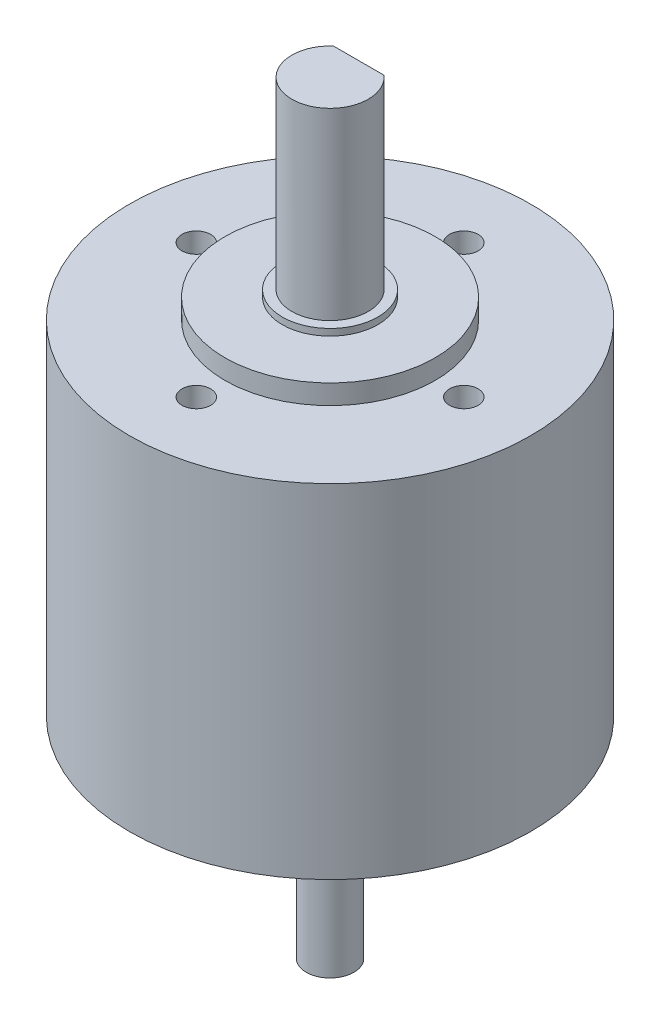
ISO-10303-21;
HEADER;
FILE_DESCRIPTION(('STEP AP214'),'2;1');
FILE_NAME('part.step','',(''),(''),'','','');
FILE_SCHEMA(('AUTOMOTIVE_DESIGN { 1 0 10303 214 1 1 1 1 }'));
ENDSEC;
DATA;
#1=APPLICATION_CONTEXT('core data for automotive mechanical design processes');
#2=APPLICATION_PROTOCOL_DEFINITION('international standard','automotive_design',2000,#1);
#3=PRODUCT_CONTEXT('',#1,'mechanical');
#4=PRODUCT('Part','Part','',(#3));
#5=PRODUCT_RELATED_PRODUCT_CATEGORY('part','',(#4));
#6=PRODUCT_DEFINITION_FORMATION('','',#4);
#7=PRODUCT_DEFINITION_CONTEXT('part definition',#1,'design');
#8=PRODUCT_DEFINITION('design','',#6,#7);
#9=PRODUCT_DEFINITION_SHAPE('','',#8);
#10=(LENGTH_UNIT() NAMED_UNIT(*) SI_UNIT(.MILLI.,.METRE.));
#11=(NAMED_UNIT(*) PLANE_ANGLE_UNIT() SI_UNIT($,.RADIAN.));
#12=(NAMED_UNIT(*) SI_UNIT($,.STERADIAN.) SOLID_ANGLE_UNIT());
#13=UNCERTAINTY_MEASURE_WITH_UNIT(LENGTH_MEASURE(1.E-05),#10,'distance_accuracy_value','');
#14=(GEOMETRIC_REPRESENTATION_CONTEXT(3) GLOBAL_UNCERTAINTY_ASSIGNED_CONTEXT((#13)) GLOBAL_UNIT_ASSIGNED_CONTEXT((#10,
#11,#12)) REPRESENTATION_CONTEXT('',''));
#15=CARTESIAN_POINT('',(0.,0.,0.));
#16=DIRECTION('',(0.,0.,1.));
#17=DIRECTION('',(1.,0.,0.));
#18=AXIS2_PLACEMENT_3D('',#15,#16,#17);
#19=CARTESIAN_POINT('',(0.,17.9451,0.));
#20=DIRECTION('',(0.,-1.,0.));
#21=DIRECTION('',(0.,0.,-1.));
#22=AXIS2_PLACEMENT_3D('',#19,#20,#21);
#23=CYLINDRICAL_SURFACE('',#22,21.);
#24=CARTESIAN_POINT('',(0.,17.9451,0.));
#25=DIRECTION('',(0.,1.,0.));
#26=DIRECTION('',(0.,0.,1.));
#27=AXIS2_PLACEMENT_3D('',#24,#25,#26);
#28=CIRCLE('',#27,21.);
#29=CARTESIAN_POINT('',(0.,17.9451,21.));
#30=VERTEX_POINT('',#29);
#31=EDGE_CURVE('E150',#30,#30,#28,.T.);
#32=ORIENTED_EDGE('',*,*,#31,.F.);
#33=EDGE_LOOP('',(#32));
#34=FACE_BOUND('',#33,.T.);
#35=CARTESIAN_POINT('',(0.,-17.9451,0.));
#36=DIRECTION('',(0.,1.,0.));
#37=DIRECTION('',(0.,0.,1.));
#38=AXIS2_PLACEMENT_3D('',#35,#36,#37);
#39=CIRCLE('',#38,21.);
#40=CARTESIAN_POINT('',(0.,-17.9451,21.));
#41=VERTEX_POINT('',#40);
#42=EDGE_CURVE('E149',#41,#41,#39,.T.);
#43=ORIENTED_EDGE('',*,*,#42,.T.);
#44=EDGE_LOOP('',(#43));
#45=FACE_BOUND('',#44,.T.);
#46=ADVANCED_FACE('F38',(#34,#45),#23,.T.);
#47=CARTESIAN_POINT('',(0.,17.9451,0.));
#48=DIRECTION('',(0.,1.,0.));
#49=DIRECTION('',(0.,0.,1.));
#50=AXIS2_PLACEMENT_3D('',#47,#48,#49);
#51=PLANE('',#50);
#52=CARTESIAN_POINT('',(0.,17.9451,-14.));
#53=DIRECTION('',(0.,1.,0.));
#54=DIRECTION('',(0.,0.,1.));
#55=AXIS2_PLACEMENT_3D('',#52,#53,#54);
#56=CIRCLE('',#55,1.5);
#57=CARTESIAN_POINT('',(0.,17.9451,-12.5));
#58=VERTEX_POINT('',#57);
#59=EDGE_CURVE('E107',#58,#58,#56,.T.);
#60=ORIENTED_EDGE('',*,*,#59,.F.);
#61=EDGE_LOOP('',(#60));
#62=FACE_BOUND('',#61,.T.);
#63=CARTESIAN_POINT('',(-14.,17.9451,0.));
#64=DIRECTION('',(0.,1.,0.));
#65=DIRECTION('',(0.,0.,1.));
#66=AXIS2_PLACEMENT_3D('',#63,#64,#65);
#67=CIRCLE('',#66,1.5);
#68=CARTESIAN_POINT('',(-14.,17.9451,1.5));
#69=VERTEX_POINT('',#68);
#70=EDGE_CURVE('E113',#69,#69,#67,.T.);
#71=ORIENTED_EDGE('',*,*,#70,.F.);
#72=EDGE_LOOP('',(#71));
#73=FACE_BOUND('',#72,.T.);
#74=CARTESIAN_POINT('',(0.,17.9451,14.));
#75=DIRECTION('',(0.,1.,0.));
#76=DIRECTION('',(0.,0.,1.));
#77=AXIS2_PLACEMENT_3D('',#74,#75,#76);
#78=CIRCLE('',#77,1.5);
#79=CARTESIAN_POINT('',(0.,17.9451,15.5));
#80=VERTEX_POINT('',#79);
#81=EDGE_CURVE('E119',#80,#80,#78,.T.);
#82=ORIENTED_EDGE('',*,*,#81,.F.);
#83=EDGE_LOOP('',(#82));
#84=FACE_BOUND('',#83,.T.);
#85=CARTESIAN_POINT('',(14.,17.9451,0.));
#86=DIRECTION('',(0.,1.,0.));
#87=DIRECTION('',(0.,0.,1.));
#88=AXIS2_PLACEMENT_3D('',#85,#86,#87);
#89=CIRCLE('',#88,1.5);
#90=CARTESIAN_POINT('',(14.,17.9451,1.5));
#91=VERTEX_POINT('',#90);
#92=EDGE_CURVE('E102',#91,#91,#89,.T.);
#93=ORIENTED_EDGE('',*,*,#92,.F.);
#94=EDGE_LOOP('',(#93));
#95=FACE_BOUND('',#94,.T.);
#96=CARTESIAN_POINT('',(0.,17.9451,0.));
#97=DIRECTION('',(0.,1.,0.));
#98=DIRECTION('',(0.,0.,1.));
#99=AXIS2_PLACEMENT_3D('',#96,#97,#98);
#100=CIRCLE('',#99,11.);
#101=CARTESIAN_POINT('',(0.,17.9451,11.));
#102=VERTEX_POINT('',#101);
#103=EDGE_CURVE('E144',#102,#102,#100,.F.);
#104=ORIENTED_EDGE('',*,*,#103,.T.);
#105=EDGE_LOOP('',(#104));
#106=FACE_BOUND('',#105,.T.);
#107=ORIENTED_EDGE('',*,*,#31,.T.);
#108=EDGE_LOOP('',(#107));
#109=FACE_BOUND('',#108,.T.);
#110=ADVANCED_FACE('F193',(#62,#73,#84,#95,#106,#109),#51,.T.);
#111=CARTESIAN_POINT('',(0.,-17.9451,0.));
#112=DIRECTION('',(0.,1.,0.));
#113=DIRECTION('',(0.,0.,1.));
#114=AXIS2_PLACEMENT_3D('',#111,#112,#113);
#115=PLANE('',#114);
#116=CARTESIAN_POINT('',(0.,-17.9451,0.));
#117=DIRECTION('',(0.,1.,0.));
#118=DIRECTION('',(0.,0.,1.));
#119=AXIS2_PLACEMENT_3D('',#116,#117,#118);
#120=CIRCLE('',#119,11.);
#121=CARTESIAN_POINT('',(0.,-17.9451,11.));
#122=VERTEX_POINT('',#121);
#123=EDGE_CURVE('E153',#122,#122,#120,.F.);
#124=ORIENTED_EDGE('',*,*,#123,.F.);
#125=EDGE_LOOP('',(#124));
#126=FACE_BOUND('',#125,.T.);
#127=ORIENTED_EDGE('',*,*,#42,.F.);
#128=EDGE_LOOP('',(#127));
#129=FACE_BOUND('',#128,.T.);
#130=ADVANCED_FACE('F198',(#126,#129),#115,.F.);
#131=CARTESIAN_POINT('',(0.,-20.0025,0.));
#132=DIRECTION('',(0.,1.,0.));
#133=DIRECTION('',(0.,0.,1.));
#134=AXIS2_PLACEMENT_3D('',#131,#132,#133);
#135=PLANE('',#134);
#136=CARTESIAN_POINT('',(0.,-20.0025,0.));
#137=DIRECTION('',(0.,1.,0.));
#138=DIRECTION('',(0.,0.,1.));
#139=AXIS2_PLACEMENT_3D('',#136,#137,#138);
#140=CIRCLE('',#139,5.);
#141=CARTESIAN_POINT('',(0.,-20.0025,5.));
#142=VERTEX_POINT('',#141);
#143=EDGE_CURVE('E13',#142,#142,#140,.F.);
#144=ORIENTED_EDGE('',*,*,#143,.F.);
#145=EDGE_LOOP('',(#144));
#146=FACE_BOUND('',#145,.T.);
#147=CARTESIAN_POINT('',(0.,-20.0025,0.));
#148=DIRECTION('',(0.,1.,0.));
#149=DIRECTION('',(0.,0.,1.));
#150=AXIS2_PLACEMENT_3D('',#147,#148,#149);
#151=CIRCLE('',#150,11.);
#152=CARTESIAN_POINT('',(0.,-20.0025,11.));
#153=VERTEX_POINT('',#152);
#154=EDGE_CURVE('E140',#153,#153,#151,.T.);
#155=ORIENTED_EDGE('',*,*,#154,.F.);
#156=EDGE_LOOP('',(#155));
#157=FACE_BOUND('',#156,.T.);
#158=ADVANCED_FACE('F206',(#146,#157),#135,.F.);
#159=CARTESIAN_POINT('',(0.,20.0025,0.));
#160=DIRECTION('',(0.,-1.,0.));
#161=DIRECTION('',(0.,0.,-1.));
#162=AXIS2_PLACEMENT_3D('',#159,#160,#161);
#163=CYLINDRICAL_SURFACE('',#162,11.);
#164=ORIENTED_EDGE('',*,*,#154,.T.);
#165=EDGE_LOOP('',(#164));
#166=FACE_BOUND('',#165,.T.);
#167=ORIENTED_EDGE('',*,*,#123,.T.);
#168=EDGE_LOOP('',(#167));
#169=FACE_BOUND('',#168,.T.);
#170=ADVANCED_FACE('F211',(#166,#169),#163,.T.);
#171=ORIENTED_EDGE('',*,*,#103,.F.);
#172=EDGE_LOOP('',(#171));
#173=FACE_BOUND('',#172,.T.);
#174=CARTESIAN_POINT('',(0.,20.0025,0.));
#175=DIRECTION('',(0.,1.,0.));
#176=DIRECTION('',(0.,0.,1.));
#177=AXIS2_PLACEMENT_3D('',#174,#175,#176);
#178=CIRCLE('',#177,11.);
#179=CARTESIAN_POINT('',(0.,20.0025,11.));
#180=VERTEX_POINT('',#179);
#181=EDGE_CURVE('E141',#180,#180,#178,.T.);
#182=ORIENTED_EDGE('',*,*,#181,.F.);
#183=EDGE_LOOP('',(#182));
#184=FACE_BOUND('',#183,.T.);
#185=ADVANCED_FACE('F216',(#173,#184),#163,.T.);
#186=CARTESIAN_POINT('',(0.,20.0025,0.));
#187=DIRECTION('',(0.,1.,0.));
#188=DIRECTION('',(0.,0.,1.));
#189=AXIS2_PLACEMENT_3D('',#186,#187,#188);
#190=PLANE('',#189);
#191=CARTESIAN_POINT('',(0.,20.0025,0.));
#192=DIRECTION('',(0.,1.,0.));
#193=DIRECTION('',(0.,0.,1.));
#194=AXIS2_PLACEMENT_3D('',#191,#192,#193);
#195=CIRCLE('',#194,5.);
#196=CARTESIAN_POINT('',(0.,20.0025,5.));
#197=VERTEX_POINT('',#196);
#198=EDGE_CURVE('E41',#197,#197,#195,.F.);
#199=ORIENTED_EDGE('',*,*,#198,.T.);
#200=EDGE_LOOP('',(#199));
#201=FACE_BOUND('',#200,.T.);
#202=ORIENTED_EDGE('',*,*,#181,.T.);
#203=EDGE_LOOP('',(#202));
#204=FACE_BOUND('',#203,.T.);
#205=ADVANCED_FACE('F218',(#201,#204),#190,.T.);
#206=CARTESIAN_POINT('',(14.,13.9451,0.));
#207=DIRECTION('',(0.,1.,0.));
#208=DIRECTION('',(0.,0.,1.));
#209=AXIS2_PLACEMENT_3D('',#206,#207,#208);
#210=CYLINDRICAL_SURFACE('',#209,1.5);
#211=CARTESIAN_POINT('',(14.,13.9451,0.));
#212=DIRECTION('',(0.,1.,0.));
#213=DIRECTION('',(0.,0.,1.));
#214=AXIS2_PLACEMENT_3D('',#211,#212,#213);
#215=CIRCLE('',#214,1.5);
#216=CARTESIAN_POINT('',(14.,13.9451,1.5));
#217=VERTEX_POINT('',#216);
#218=EDGE_CURVE('E122',#217,#217,#215,.T.);
#219=ORIENTED_EDGE('',*,*,#218,.F.);
#220=EDGE_LOOP('',(#219));
#221=FACE_BOUND('',#220,.T.);
#222=ORIENTED_EDGE('',*,*,#92,.T.);
#223=EDGE_LOOP('',(#222));
#224=FACE_BOUND('',#223,.T.);
#225=ADVANCED_FACE('F223',(#221,#224),#210,.F.);
#226=CARTESIAN_POINT('',(14.,13.9451,0.));
#227=DIRECTION('',(0.,1.,0.));
#228=DIRECTION('',(0.,0.,1.));
#229=AXIS2_PLACEMENT_3D('',#226,#227,#228);
#230=PLANE('',#229);
#231=ORIENTED_EDGE('',*,*,#218,.T.);
#232=EDGE_LOOP('',(#231));
#233=FACE_BOUND('',#232,.T.);
#234=ADVANCED_FACE('F242',(#233),#230,.T.);
#235=CARTESIAN_POINT('',(0.,13.9451,14.));
#236=DIRECTION('',(0.,1.,0.));
#237=DIRECTION('',(0.,0.,1.));
#238=AXIS2_PLACEMENT_3D('',#235,#236,#237);
#239=CYLINDRICAL_SURFACE('',#238,1.5);
#240=CARTESIAN_POINT('',(0.,13.9451,14.));
#241=DIRECTION('',(0.,1.,0.));
#242=DIRECTION('',(0.,0.,1.));
#243=AXIS2_PLACEMENT_3D('',#240,#241,#242);
#244=CIRCLE('',#243,1.5);
#245=CARTESIAN_POINT('',(0.,13.9451,15.5));
#246=VERTEX_POINT('',#245);
#247=EDGE_CURVE('E116',#246,#246,#244,.T.);
#248=ORIENTED_EDGE('',*,*,#247,.F.);
#249=EDGE_LOOP('',(#248));
#250=FACE_BOUND('',#249,.T.);
#251=ORIENTED_EDGE('',*,*,#81,.T.);
#252=EDGE_LOOP('',(#251));
#253=FACE_BOUND('',#252,.T.);
#254=ADVANCED_FACE('F246',(#250,#253),#239,.F.);
#255=CARTESIAN_POINT('',(0.,13.9451,14.));
#256=DIRECTION('',(0.,1.,0.));
#257=DIRECTION('',(0.,0.,1.));
#258=AXIS2_PLACEMENT_3D('',#255,#256,#257);
#259=PLANE('',#258);
#260=ORIENTED_EDGE('',*,*,#247,.T.);
#261=EDGE_LOOP('',(#260));
#262=FACE_BOUND('',#261,.T.);
#263=ADVANCED_FACE('F250',(#262),#259,.T.);
#264=CARTESIAN_POINT('',(-14.,13.9451,0.));
#265=DIRECTION('',(0.,1.,0.));
#266=DIRECTION('',(0.,0.,1.));
#267=AXIS2_PLACEMENT_3D('',#264,#265,#266);
#268=CYLINDRICAL_SURFACE('',#267,1.5);
#269=CARTESIAN_POINT('',(-14.,13.9451,0.));
#270=DIRECTION('',(0.,1.,0.));
#271=DIRECTION('',(0.,0.,1.));
#272=AXIS2_PLACEMENT_3D('',#269,#270,#271);
#273=CIRCLE('',#272,1.5);
#274=CARTESIAN_POINT('',(-14.,13.9451,1.5));
#275=VERTEX_POINT('',#274);
#276=EDGE_CURVE('E110',#275,#275,#273,.T.);
#277=ORIENTED_EDGE('',*,*,#276,.F.);
#278=EDGE_LOOP('',(#277));
#279=FACE_BOUND('',#278,.T.);
#280=ORIENTED_EDGE('',*,*,#70,.T.);
#281=EDGE_LOOP('',(#280));
#282=FACE_BOUND('',#281,.T.);
#283=ADVANCED_FACE('F254',(#279,#282),#268,.F.);
#284=CARTESIAN_POINT('',(-14.,13.9451,0.));
#285=DIRECTION('',(0.,1.,0.));
#286=DIRECTION('',(0.,0.,1.));
#287=AXIS2_PLACEMENT_3D('',#284,#285,#286);
#288=PLANE('',#287);
#289=ORIENTED_EDGE('',*,*,#276,.T.);
#290=EDGE_LOOP('',(#289));
#291=FACE_BOUND('',#290,.T.);
#292=ADVANCED_FACE('F258',(#291),#288,.T.);
#293=CARTESIAN_POINT('',(0.,13.9451,-14.));
#294=DIRECTION('',(0.,1.,0.));
#295=DIRECTION('',(0.,0.,1.));
#296=AXIS2_PLACEMENT_3D('',#293,#294,#295);
#297=CYLINDRICAL_SURFACE('',#296,1.5);
#298=CARTESIAN_POINT('',(0.,13.9451,-14.));
#299=DIRECTION('',(0.,1.,0.));
#300=DIRECTION('',(0.,0.,1.));
#301=AXIS2_PLACEMENT_3D('',#298,#299,#300);
#302=CIRCLE('',#301,1.5);
#303=CARTESIAN_POINT('',(0.,13.9451,-12.5));
#304=VERTEX_POINT('',#303);
#305=EDGE_CURVE('E103',#304,#304,#302,.T.);
#306=ORIENTED_EDGE('',*,*,#305,.F.);
#307=EDGE_LOOP('',(#306));
#308=FACE_BOUND('',#307,.T.);
#309=ORIENTED_EDGE('',*,*,#59,.T.);
#310=EDGE_LOOP('',(#309));
#311=FACE_BOUND('',#310,.T.);
#312=ADVANCED_FACE('F188',(#308,#311),#297,.F.);
#313=CARTESIAN_POINT('',(0.,13.9451,-14.));
#314=DIRECTION('',(0.,1.,0.));
#315=DIRECTION('',(0.,0.,1.));
#316=AXIS2_PLACEMENT_3D('',#313,#314,#315);
#317=PLANE('',#316);
#318=ORIENTED_EDGE('',*,*,#305,.T.);
#319=EDGE_LOOP('',(#318));
#320=FACE_BOUND('',#319,.T.);
#321=ADVANCED_FACE('F179',(#320),#317,.T.);
#322=CARTESIAN_POINT('',(0.,-20.701,0.));
#323=DIRECTION('',(0.,1.,0.));
#324=DIRECTION('',(0.,0.,1.));
#325=AXIS2_PLACEMENT_3D('',#322,#323,#324);
#326=PLANE('',#325);
#327=CARTESIAN_POINT('',(0.,-20.701,0.));
#328=DIRECTION('',(0.,1.,0.));
#329=DIRECTION('',(0.,0.,1.));
#330=AXIS2_PLACEMENT_3D('',#327,#328,#329);
#331=CIRCLE('',#330,2.5);
#332=CARTESIAN_POINT('',(0.,-20.701,2.5));
#333=VERTEX_POINT('',#332);
#334=EDGE_CURVE('E46',#333,#333,#331,.T.);
#335=ORIENTED_EDGE('',*,*,#334,.T.);
#336=EDGE_LOOP('',(#335));
#337=FACE_BOUND('',#336,.T.);
#338=CARTESIAN_POINT('',(0.,-20.701,0.));
#339=DIRECTION('',(0.,1.,0.));
#340=DIRECTION('',(0.,0.,1.));
#341=AXIS2_PLACEMENT_3D('',#338,#339,#340);
#342=CIRCLE('',#341,5.);
#343=CARTESIAN_POINT('',(0.,-20.701,5.));
#344=VERTEX_POINT('',#343);
#345=EDGE_CURVE('E166',#344,#344,#342,.T.);
#346=ORIENTED_EDGE('',*,*,#345,.F.);
#347=EDGE_LOOP('',(#346));
#348=FACE_BOUND('',#347,.T.);
#349=ADVANCED_FACE('F177',(#337,#348),#326,.F.);
#350=CARTESIAN_POINT('',(0.,20.701,0.));
#351=DIRECTION('',(0.,-1.,0.));
#352=DIRECTION('',(0.,0.,-1.));
#353=AXIS2_PLACEMENT_3D('',#350,#351,#352);
#354=CYLINDRICAL_SURFACE('',#353,5.);
#355=ORIENTED_EDGE('',*,*,#345,.T.);
#356=EDGE_LOOP('',(#355));
#357=FACE_BOUND('',#356,.T.);
#358=ORIENTED_EDGE('',*,*,#143,.T.);
#359=EDGE_LOOP('',(#358));
#360=FACE_BOUND('',#359,.T.);
#361=ADVANCED_FACE('F174',(#357,#360),#354,.T.);
#362=CARTESIAN_POINT('',(0.,-23.0025,0.));
#363=DIRECTION('',(0.,1.,0.));
#364=DIRECTION('',(0.,0.,1.));
#365=AXIS2_PLACEMENT_3D('',#362,#363,#364);
#366=PLANE('',#365);
#367=CARTESIAN_POINT('',(0.,-23.0025,0.));
#368=DIRECTION('',(0.,1.,0.));
#369=DIRECTION('',(0.,0.,1.));
#370=AXIS2_PLACEMENT_3D('',#367,#368,#369);
#371=CIRCLE('',#370,2.5);
#372=CARTESIAN_POINT('',(-2.,-23.0025,-1.5));
#373=VERTEX_POINT('',#372);
#374=CARTESIAN_POINT('',(2.,-23.0025,-1.5));
#375=VERTEX_POINT('',#374);
#376=EDGE_CURVE('E89',#373,#375,#371,.F.);
#377=ORIENTED_EDGE('',*,*,#376,.T.);
#378=DIRECTION('',(-1.,0.,0.));
#379=VECTOR('',#378,1.);
#380=CARTESIAN_POINT('',(-2.,-23.0025,-1.5));
#381=LINE('',#380,#379);
#382=EDGE_CURVE('E82',#375,#373,#381,.T.);
#383=ORIENTED_EDGE('',*,*,#382,.T.);
#384=EDGE_LOOP('',(#377,#383));
#385=FACE_BOUND('',#384,.T.);
#386=ADVANCED_FACE('F92',(#385),#366,.F.);
#387=CARTESIAN_POINT('',(-2.,-15.8793943743823,-1.5));
#388=DIRECTION('',(0.,0.,1.));
#389=DIRECTION('',(1.,0.,0.));
#390=AXIS2_PLACEMENT_3D('',#387,#388,#389);
#391=PLANE('',#390);
#392=DIRECTION('',(0.,-1.,0.));
#393=VECTOR('',#392,1.);
#394=CARTESIAN_POINT('',(2.,-15.8793943743823,-1.5));
#395=LINE('',#394,#393);
#396=CARTESIAN_POINT('',(2.,-39.9451,-1.5));
#397=VERTEX_POINT('',#396);
#398=EDGE_CURVE('E54',#375,#397,#395,.T.);
#399=ORIENTED_EDGE('',*,*,#398,.T.);
#400=DIRECTION('',(-1.,0.,0.));
#401=VECTOR('',#400,1.);
#402=CARTESIAN_POINT('',(-2.,-39.9451,-1.5));
#403=LINE('',#402,#401);
#404=CARTESIAN_POINT('',(-2.,-39.9451,-1.5));
#405=VERTEX_POINT('',#404);
#406=EDGE_CURVE('E84',#397,#405,#403,.T.);
#407=ORIENTED_EDGE('',*,*,#406,.T.);
#408=DIRECTION('',(0.,-1.,0.));
#409=VECTOR('',#408,1.);
#410=CARTESIAN_POINT('',(-2.,-15.8793943743823,-1.5));
#411=LINE('',#410,#409);
#412=EDGE_CURVE('E79',#373,#405,#411,.T.);
#413=ORIENTED_EDGE('',*,*,#412,.F.);
#414=ORIENTED_EDGE('',*,*,#382,.F.);
#415=EDGE_LOOP('',(#399,#407,#413,#414));
#416=FACE_BOUND('',#415,.T.);
#417=ADVANCED_FACE('F81',(#416),#391,.F.);
#418=CARTESIAN_POINT('',(0.,-39.9451,0.));
#419=DIRECTION('',(0.,1.,0.));
#420=DIRECTION('',(0.,0.,1.));
#421=AXIS2_PLACEMENT_3D('',#418,#419,#420);
#422=PLANE('',#421);
#423=CARTESIAN_POINT('',(0.,-39.9451,0.));
#424=DIRECTION('',(0.,1.,0.));
#425=DIRECTION('',(0.,0.,1.));
#426=AXIS2_PLACEMENT_3D('',#423,#424,#425);
#427=CIRCLE('',#426,2.5);
#428=EDGE_CURVE('E97',#405,#397,#427,.T.);
#429=ORIENTED_EDGE('',*,*,#428,.F.);
#430=ORIENTED_EDGE('',*,*,#406,.F.);
#431=EDGE_LOOP('',(#429,#430));
#432=FACE_BOUND('',#431,.T.);
#433=ADVANCED_FACE('F268',(#432),#422,.F.);
#434=CARTESIAN_POINT('',(0.,-69.0161678118655,0.));
#435=DIRECTION('',(0.,1.,0.));
#436=DIRECTION('',(0.,0.,1.));
#437=AXIS2_PLACEMENT_3D('',#434,#435,#436);
#438=CYLINDRICAL_SURFACE('',#437,2.5);
#439=ORIENTED_EDGE('',*,*,#428,.T.);
#440=ORIENTED_EDGE('',*,*,#398,.F.);
#441=ORIENTED_EDGE('',*,*,#376,.F.);
#442=ORIENTED_EDGE('',*,*,#412,.T.);
#443=EDGE_LOOP('',(#439,#440,#441,#442));
#444=FACE_BOUND('',#443,.T.);
#445=ORIENTED_EDGE('',*,*,#334,.F.);
#446=EDGE_LOOP('',(#445));
#447=FACE_BOUND('',#446,.T.);
#448=ADVANCED_FACE('F94',(#444,#447),#438,.T.);
#449=ORIENTED_EDGE('',*,*,#198,.F.);
#450=EDGE_LOOP('',(#449));
#451=FACE_BOUND('',#450,.T.);
#452=CARTESIAN_POINT('',(0.,20.701,0.));
#453=DIRECTION('',(0.,1.,0.));
#454=DIRECTION('',(0.,0.,1.));
#455=AXIS2_PLACEMENT_3D('',#452,#453,#454);
#456=CIRCLE('',#455,5.);
#457=CARTESIAN_POINT('',(0.,20.701,5.));
#458=VERTEX_POINT('',#457);
#459=EDGE_CURVE('E161',#458,#458,#456,.T.);
#460=ORIENTED_EDGE('',*,*,#459,.F.);
#461=EDGE_LOOP('',(#460));
#462=FACE_BOUND('',#461,.T.);
#463=ADVANCED_FACE('F187',(#451,#462),#354,.T.);
#464=CARTESIAN_POINT('',(0.,20.701,0.));
#465=DIRECTION('',(0.,1.,0.));
#466=DIRECTION('',(0.,0.,1.));
#467=AXIS2_PLACEMENT_3D('',#464,#465,#466);
#468=PLANE('',#467);
#469=CARTESIAN_POINT('',(0.,20.701,0.));
#470=DIRECTION('',(0.,1.,0.));
#471=DIRECTION('',(0.,0.,1.));
#472=AXIS2_PLACEMENT_3D('',#469,#470,#471);
#473=CIRCLE('',#472,4.);
#474=CARTESIAN_POINT('',(0.,20.701,4.));
#475=VERTEX_POINT('',#474);
#476=EDGE_CURVE('E159',#475,#475,#473,.T.);
#477=ORIENTED_EDGE('',*,*,#476,.F.);
#478=EDGE_LOOP('',(#477));
#479=FACE_BOUND('',#478,.T.);
#480=ORIENTED_EDGE('',*,*,#459,.T.);
#481=EDGE_LOOP('',(#480));
#482=FACE_BOUND('',#481,.T.);
#483=ADVANCED_FACE('F238',(#479,#482),#468,.T.);
#484=CARTESIAN_POINT('',(0.,24.9451,0.));
#485=DIRECTION('',(0.,1.,0.));
#486=DIRECTION('',(0.,0.,1.));
#487=AXIS2_PLACEMENT_3D('',#484,#485,#486);
#488=PLANE('',#487);
#489=CARTESIAN_POINT('',(0.,24.9451,0.));
#490=DIRECTION('',(0.,1.,0.));
#491=DIRECTION('',(0.,0.,1.));
#492=AXIS2_PLACEMENT_3D('',#489,#490,#491);
#493=CIRCLE('',#492,4.);
#494=CARTESIAN_POINT('',(2.64575131106459,24.9451,-3.));
#495=VERTEX_POINT('',#494);
#496=CARTESIAN_POINT('',(-2.64575131106459,24.9451,-3.));
#497=VERTEX_POINT('',#496);
#498=EDGE_CURVE('E127',#495,#497,#493,.T.);
#499=ORIENTED_EDGE('',*,*,#498,.T.);
#500=DIRECTION('',(1.,0.,0.));
#501=VECTOR('',#500,1.);
#502=CARTESIAN_POINT('',(-2.64575131106459,24.9451,-3.));
#503=LINE('',#502,#501);
#504=EDGE_CURVE('E129',#497,#495,#503,.T.);
#505=ORIENTED_EDGE('',*,*,#504,.T.);
#506=EDGE_LOOP('',(#499,#505));
#507=FACE_BOUND('',#506,.T.);
#508=ADVANCED_FACE('F235',(#507),#488,.T.);
#509=CARTESIAN_POINT('',(-2.64575131106459,24.9451,-3.));
#510=DIRECTION('',(0.,0.,1.));
#511=DIRECTION('',(1.,0.,0.));
#512=AXIS2_PLACEMENT_3D('',#509,#510,#511);
#513=PLANE('',#512);
#514=DIRECTION('',(1.,0.,0.));
#515=VECTOR('',#514,1.);
#516=CARTESIAN_POINT('',(-2.64575131106459,39.9451,-3.));
#517=LINE('',#516,#515);
#518=CARTESIAN_POINT('',(-2.64575131106459,39.9451,-3.));
#519=VERTEX_POINT('',#518);
#520=CARTESIAN_POINT('',(2.64575131106459,39.9451,-3.));
#521=VERTEX_POINT('',#520);
#522=EDGE_CURVE('E106',#519,#521,#517,.T.);
#523=ORIENTED_EDGE('',*,*,#522,.T.);
#524=DIRECTION('',(0.,1.,0.));
#525=VECTOR('',#524,1.);
#526=CARTESIAN_POINT('',(2.64575131106459,24.9451,-3.));
#527=LINE('',#526,#525);
#528=EDGE_CURVE('E133',#495,#521,#527,.T.);
#529=ORIENTED_EDGE('',*,*,#528,.F.);
#530=ORIENTED_EDGE('',*,*,#504,.F.);
#531=DIRECTION('',(0.,1.,0.));
#532=VECTOR('',#531,1.);
#533=CARTESIAN_POINT('',(-2.64575131106459,24.9451,-3.));
#534=LINE('',#533,#532);
#535=EDGE_CURVE('E62',#497,#519,#534,.T.);
#536=ORIENTED_EDGE('',*,*,#535,.T.);
#537=EDGE_LOOP('',(#523,#529,#530,#536));
#538=FACE_BOUND('',#537,.T.);
#539=ADVANCED_FACE('F229',(#538),#513,.F.);
#540=CARTESIAN_POINT('',(0.,39.9451,0.));
#541=DIRECTION('',(0.,1.,0.));
#542=DIRECTION('',(0.,0.,1.));
#543=AXIS2_PLACEMENT_3D('',#540,#541,#542);
#544=PLANE('',#543);
#545=ORIENTED_EDGE('',*,*,#522,.F.);
#546=CARTESIAN_POINT('',(0.,39.9451,0.));
#547=DIRECTION('',(0.,1.,0.));
#548=DIRECTION('',(0.,0.,1.));
#549=AXIS2_PLACEMENT_3D('',#546,#547,#548);
#550=CIRCLE('',#549,4.);
#551=EDGE_CURVE('E136',#519,#521,#550,.T.);
#552=ORIENTED_EDGE('',*,*,#551,.T.);
#553=EDGE_LOOP('',(#545,#552));
#554=FACE_BOUND('',#553,.T.);
#555=ADVANCED_FACE('F225',(#554),#544,.T.);
#556=CARTESIAN_POINT('',(0.,73.2588084989847,0.));
#557=DIRECTION('',(0.,-1.,0.));
#558=DIRECTION('',(0.,0.,-1.));
#559=AXIS2_PLACEMENT_3D('',#556,#557,#558);
#560=CYLINDRICAL_SURFACE('',#559,4.);
#561=ORIENTED_EDGE('',*,*,#476,.T.);
#562=EDGE_LOOP('',(#561));
#563=FACE_BOUND('',#562,.T.);
#564=ORIENTED_EDGE('',*,*,#551,.F.);
#565=ORIENTED_EDGE('',*,*,#535,.F.);
#566=ORIENTED_EDGE('',*,*,#498,.F.);
#567=ORIENTED_EDGE('',*,*,#528,.T.);
#568=EDGE_LOOP('',(#564,#565,#566,#567));
#569=FACE_BOUND('',#568,.T.);
#570=ADVANCED_FACE('F228',(#563,#569),#560,.T.);
#571=CLOSED_SHELL('',(#46,#110,#130,#158,#170,#185,#205,#225,#234,#254,#263,#283,#292,#312,#321,
#349,#361,#386,#417,#433,#448,#463,#483,#508,#539,#555,#570));
#572=MANIFOLD_SOLID_BREP('B2',#571);
#573=ADVANCED_BREP_SHAPE_REPRESENTATION('',(#18,#572),#14);
#574=SHAPE_DEFINITION_REPRESENTATION(#9,#573);
ENDSEC;
END-ISO-10303-21;
